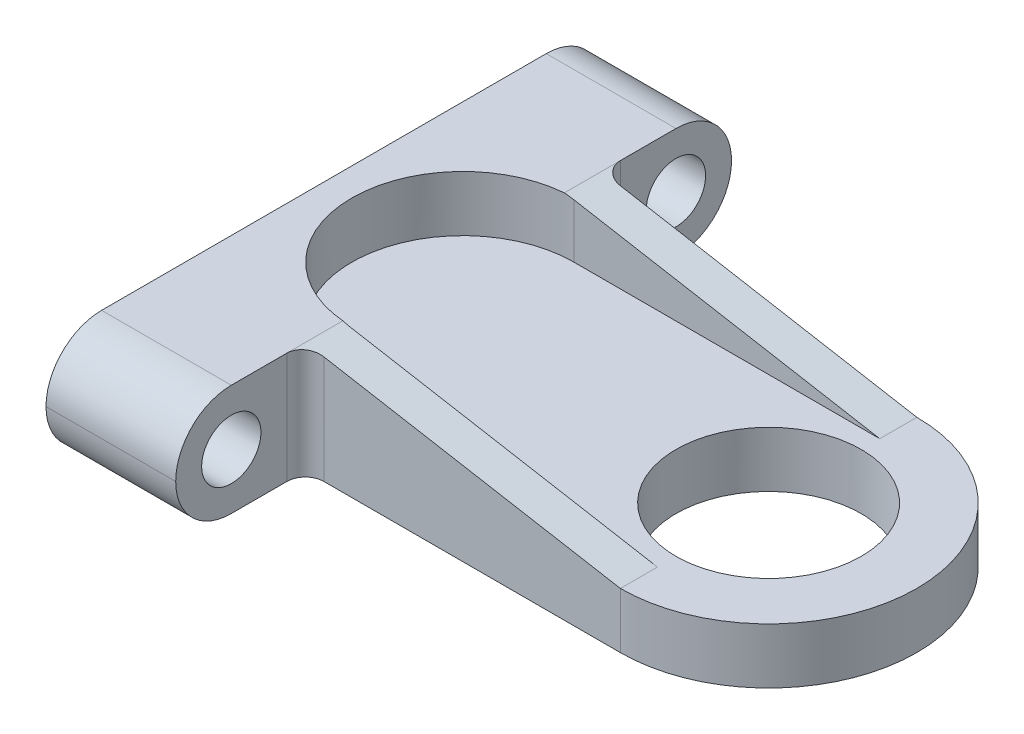
ISO-10303-21;
HEADER;
FILE_DESCRIPTION(('STEP AP214'),'2;1');
FILE_NAME('part.step','',(''),(''),'','','');
FILE_SCHEMA(('AUTOMOTIVE_DESIGN { 1 0 10303 214 1 1 1 1 }'));
ENDSEC;
DATA;
#1=APPLICATION_CONTEXT('core data for automotive mechanical design processes');
#2=APPLICATION_PROTOCOL_DEFINITION('international standard','automotive_design',2000,#1);
#3=PRODUCT_CONTEXT('',#1,'mechanical');
#4=PRODUCT('Part','Part','',(#3));
#5=PRODUCT_RELATED_PRODUCT_CATEGORY('part','',(#4));
#6=PRODUCT_DEFINITION_FORMATION('','',#4);
#7=PRODUCT_DEFINITION_CONTEXT('part definition',#1,'design');
#8=PRODUCT_DEFINITION('design','',#6,#7);
#9=PRODUCT_DEFINITION_SHAPE('','',#8);
#10=(LENGTH_UNIT() NAMED_UNIT(*) SI_UNIT(.MILLI.,.METRE.));
#11=(NAMED_UNIT(*) PLANE_ANGLE_UNIT() SI_UNIT($,.RADIAN.));
#12=(NAMED_UNIT(*) SI_UNIT($,.STERADIAN.) SOLID_ANGLE_UNIT());
#13=UNCERTAINTY_MEASURE_WITH_UNIT(LENGTH_MEASURE(1.E-05),#10,'distance_accuracy_value','');
#14=(GEOMETRIC_REPRESENTATION_CONTEXT(3) GLOBAL_UNCERTAINTY_ASSIGNED_CONTEXT((#13)) GLOBAL_UNIT_ASSIGNED_CONTEXT((#10,
#11,#12)) REPRESENTATION_CONTEXT('',''));
#15=CARTESIAN_POINT('',(0.,0.,0.));
#16=DIRECTION('',(0.,0.,1.));
#17=DIRECTION('',(1.,0.,0.));
#18=AXIS2_PLACEMENT_3D('',#15,#16,#17);
#19=CARTESIAN_POINT('',(0.,6.,0.));
#20=DIRECTION('',(0.,1.,0.));
#21=DIRECTION('',(0.,0.,1.));
#22=AXIS2_PLACEMENT_3D('',#19,#20,#21);
#23=PLANE('',#22);
#24=DIRECTION('',(0.,0.,1.));
#25=VECTOR('',#24,1.);
#26=CARTESIAN_POINT('',(-17.,6.,-15.));
#27=LINE('',#26,#25);
#28=CARTESIAN_POINT('',(-17.,6.,5.9791303715507));
#29=VERTEX_POINT('',#28);
#30=CARTESIAN_POINT('',(-17.,6.,9.));
#31=VERTEX_POINT('',#30);
#32=EDGE_CURVE('E169',#29,#31,#27,.T.);
#33=ORIENTED_EDGE('',*,*,#32,.F.);
#34=CARTESIAN_POINT('',(-16.5,6.,0.));
#35=DIRECTION('',(0.,1.,0.));
#36=DIRECTION('',(-1.,0.,0.));
#37=AXIS2_PLACEMENT_3D('',#34,#35,#36);
#38=CIRCLE('',#37,6.);
#39=CARTESIAN_POINT('',(-17.,6.,-5.9791303715507));
#40=VERTEX_POINT('',#39);
#41=EDGE_CURVE('E541',#40,#29,#38,.T.);
#42=ORIENTED_EDGE('',*,*,#41,.F.);
#43=CARTESIAN_POINT('',(-17.,6.,-9.00000000000001));
#44=VERTEX_POINT('',#43);
#45=EDGE_CURVE('E48',#44,#40,#27,.T.);
#46=ORIENTED_EDGE('',*,*,#45,.F.);
#47=DIRECTION('',(0.,0.,-1.));
#48=VECTOR('',#47,1.);
#49=CARTESIAN_POINT('',(-17.,6.,-15.));
#50=LINE('',#49,#48);
#51=CARTESIAN_POINT('',(-17.,6.,-12.));
#52=VERTEX_POINT('',#51);
#53=EDGE_CURVE('E201',#44,#52,#50,.T.);
#54=ORIENTED_EDGE('',*,*,#53,.T.);
#55=DIRECTION('',(-1.,0.,0.));
#56=VECTOR('',#55,1.);
#57=CARTESIAN_POINT('',(-24.,6.,-12.));
#58=LINE('',#57,#56);
#59=CARTESIAN_POINT('',(-24.,6.,-12.));
#60=VERTEX_POINT('',#59);
#61=EDGE_CURVE('E243',#52,#60,#58,.T.);
#62=ORIENTED_EDGE('',*,*,#61,.T.);
#63=DIRECTION('',(0.,0.,1.));
#64=VECTOR('',#63,1.);
#65=CARTESIAN_POINT('',(-24.,6.,-15.));
#66=LINE('',#65,#64);
#67=CARTESIAN_POINT('',(-24.,6.,12.));
#68=VERTEX_POINT('',#67);
#69=EDGE_CURVE('E194',#60,#68,#66,.T.);
#70=ORIENTED_EDGE('',*,*,#69,.T.);
#71=DIRECTION('',(1.,0.,0.));
#72=VECTOR('',#71,1.);
#73=CARTESIAN_POINT('',(-17.,6.,12.));
#74=LINE('',#73,#72);
#75=CARTESIAN_POINT('',(-17.,6.,12.));
#76=VERTEX_POINT('',#75);
#77=EDGE_CURVE('E241',#68,#76,#74,.T.);
#78=ORIENTED_EDGE('',*,*,#77,.T.);
#79=DIRECTION('',(0.,0.,-1.));
#80=VECTOR('',#79,1.);
#81=CARTESIAN_POINT('',(-17.,6.,8.));
#82=LINE('',#81,#80);
#83=EDGE_CURVE('E197',#76,#31,#82,.T.);
#84=ORIENTED_EDGE('',*,*,#83,.T.);
#85=EDGE_LOOP('',(#33,#42,#46,#54,#62,#70,#78,#84));
#86=FACE_BOUND('',#85,.T.);
#87=ADVANCED_FACE('F33',(#86),#23,.T.);
#88=CARTESIAN_POINT('',(0.,6.,0.));
#89=DIRECTION('',(0.,-1.,0.));
#90=DIRECTION('',(0.,0.,-1.));
#91=AXIS2_PLACEMENT_3D('',#88,#89,#90);
#92=CYLINDRICAL_SURFACE('',#91,5.);
#93=CARTESIAN_POINT('',(0.,0.,0.));
#94=DIRECTION('',(0.,1.,0.));
#95=DIRECTION('',(0.,0.,1.));
#96=AXIS2_PLACEMENT_3D('',#93,#94,#95);
#97=CIRCLE('',#96,5.);
#98=CARTESIAN_POINT('',(0.,0.,5.));
#99=VERTEX_POINT('',#98);
#100=EDGE_CURVE('E189',#99,#99,#97,.T.);
#101=ORIENTED_EDGE('',*,*,#100,.F.);
#102=EDGE_LOOP('',(#101));
#103=FACE_BOUND('',#102,.T.);
#104=CARTESIAN_POINT('',(0.,3.,0.));
#105=DIRECTION('',(0.,-1.,0.));
#106=DIRECTION('',(1.,0.,0.));
#107=AXIS2_PLACEMENT_3D('',#104,#105,#106);
#108=CIRCLE('',#107,5.);
#109=CARTESIAN_POINT('',(5.,3.,0.));
#110=VERTEX_POINT('',#109);
#111=EDGE_CURVE('E249',#110,#110,#108,.T.);
#112=ORIENTED_EDGE('',*,*,#111,.F.);
#113=EDGE_LOOP('',(#112));
#114=FACE_BOUND('',#113,.T.);
#115=ADVANCED_FACE('F352',(#103,#114),#92,.F.);
#116=CARTESIAN_POINT('',(0.,3.,-15.));
#117=DIRECTION('',(-0.173785333909048,-0.984783558817937,0.));
#118=DIRECTION('',(0.984783558817937,-0.173785333909048,0.));
#119=AXIS2_PLACEMENT_3D('',#116,#117,#118);
#120=PLANE('',#119);
#121=DIRECTION('',(-0.984783558817937,0.173785333909048,0.));
#122=VECTOR('',#121,1.);
#123=CARTESIAN_POINT('',(0.,3.,-6.));
#124=LINE('',#123,#122);
#125=CARTESIAN_POINT('',(0.,3.,-6.));
#126=VERTEX_POINT('',#125);
#127=CARTESIAN_POINT('',(-16.5,5.91176470588235,-6.));
#128=VERTEX_POINT('',#127);
#129=EDGE_CURVE('E144',#126,#128,#124,.T.);
#130=ORIENTED_EDGE('',*,*,#129,.F.);
#131=DIRECTION('',(0.,0.,1.));
#132=VECTOR('',#131,1.);
#133=CARTESIAN_POINT('',(0.,3.,-15.));
#134=LINE('',#133,#132);
#135=CARTESIAN_POINT('',(0.,3.,-8.));
#136=VERTEX_POINT('',#135);
#137=EDGE_CURVE('E158',#136,#126,#134,.T.);
#138=ORIENTED_EDGE('',*,*,#137,.F.);
#139=DIRECTION('',(0.984783558817937,-0.173785333909048,0.));
#140=VECTOR('',#139,1.);
#141=CARTESIAN_POINT('',(-0.513422818791947,3.09060402684564,-8.));
#142=LINE('',#141,#140);
#143=CARTESIAN_POINT('',(-16.,5.82352941176471,-8.));
#144=VERTEX_POINT('',#143);
#145=EDGE_CURVE('E175',#144,#136,#142,.T.);
#146=ORIENTED_EDGE('',*,*,#145,.F.);
#147=CARTESIAN_POINT('',(-16.,5.82352941176471,-9.));
#148=DIRECTION('',(-0.173785333909048,-0.984783558817937,0.));
#149=DIRECTION('',(-0.984783558817937,0.173785333909048,0.));
#150=AXIS2_PLACEMENT_3D('',#147,#148,#149);
#151=ELLIPSE('',#150,1.01545155891953,1.);
#152=EDGE_CURVE('E277',#144,#44,#151,.T.);
#153=ORIENTED_EDGE('',*,*,#152,.T.);
#154=ORIENTED_EDGE('',*,*,#45,.T.);
#155=CARTESIAN_POINT('',(-16.5,5.91176470588235,0.));
#156=DIRECTION('',(-0.173785333909048,-0.984783558817937,0.));
#157=DIRECTION('',(0.984783558817937,-0.173785333909048,0.));
#158=AXIS2_PLACEMENT_3D('',#155,#156,#157);
#159=ELLIPSE('',#158,6.0927093535172,6.);
#160=EDGE_CURVE('E160',#128,#40,#159,.F.);
#161=ORIENTED_EDGE('',*,*,#160,.F.);
#162=EDGE_LOOP('',(#130,#138,#146,#153,#154,#161));
#163=FACE_BOUND('',#162,.T.);
#164=ADVANCED_FACE('F156',(#163),#120,.F.);
#165=CARTESIAN_POINT('',(-16.5,5.91176470588235,6.));
#166=VERTEX_POINT('',#165);
#167=EDGE_CURVE('E263',#29,#166,#159,.F.);
#168=ORIENTED_EDGE('',*,*,#167,.F.);
#169=ORIENTED_EDGE('',*,*,#32,.T.);
#170=CARTESIAN_POINT('',(-16.,5.82352941176471,9.));
#171=DIRECTION('',(-0.173785333909048,-0.984783558817937,0.));
#172=DIRECTION('',(-0.984783558817937,0.173785333909048,0.));
#173=AXIS2_PLACEMENT_3D('',#170,#171,#172);
#174=ELLIPSE('',#173,1.01545155891953,1.);
#175=CARTESIAN_POINT('',(-16.,5.82352941176471,8.));
#176=VERTEX_POINT('',#175);
#177=EDGE_CURVE('E11',#31,#176,#174,.T.);
#178=ORIENTED_EDGE('',*,*,#177,.T.);
#179=DIRECTION('',(-0.984783558817937,0.173785333909048,0.));
#180=VECTOR('',#179,1.);
#181=CARTESIAN_POINT('',(-0.513422818791947,3.09060402684564,8.));
#182=LINE('',#181,#180);
#183=CARTESIAN_POINT('',(0.,3.,8.));
#184=VERTEX_POINT('',#183);
#185=EDGE_CURVE('E177',#184,#176,#182,.T.);
#186=ORIENTED_EDGE('',*,*,#185,.F.);
#187=CARTESIAN_POINT('',(0.,3.,6.));
#188=VERTEX_POINT('',#187);
#189=EDGE_CURVE('E170',#188,#184,#134,.T.);
#190=ORIENTED_EDGE('',*,*,#189,.F.);
#191=DIRECTION('',(0.984783558817937,-0.173785333909048,0.));
#192=VECTOR('',#191,1.);
#193=CARTESIAN_POINT('',(0.,3.,6.));
#194=LINE('',#193,#192);
#195=EDGE_CURVE('E261',#166,#188,#194,.T.);
#196=ORIENTED_EDGE('',*,*,#195,.F.);
#197=EDGE_LOOP('',(#168,#169,#178,#186,#190,#196));
#198=FACE_BOUND('',#197,.T.);
#199=ADVANCED_FACE('F298',(#198),#120,.F.);
#200=CARTESIAN_POINT('',(0.,0.,0.));
#201=DIRECTION('',(0.,1.,0.));
#202=DIRECTION('',(0.,0.,1.));
#203=AXIS2_PLACEMENT_3D('',#200,#201,#202);
#204=PLANE('',#203);
#205=DIRECTION('',(0.,0.,1.));
#206=VECTOR('',#205,1.);
#207=CARTESIAN_POINT('',(-24.,0.,-15.));
#208=LINE('',#207,#206);
#209=CARTESIAN_POINT('',(-24.,0.,-12.));
#210=VERTEX_POINT('',#209);
#211=CARTESIAN_POINT('',(-24.,0.,12.));
#212=VERTEX_POINT('',#211);
#213=EDGE_CURVE('E192',#210,#212,#208,.T.);
#214=ORIENTED_EDGE('',*,*,#213,.F.);
#215=DIRECTION('',(-1.,0.,0.));
#216=VECTOR('',#215,1.);
#217=CARTESIAN_POINT('',(0.,0.,-12.));
#218=LINE('',#217,#216);
#219=CARTESIAN_POINT('',(-17.,0.,-12.));
#220=VERTEX_POINT('',#219);
#221=EDGE_CURVE('E233',#210,#220,#218,.F.);
#222=ORIENTED_EDGE('',*,*,#221,.T.);
#223=DIRECTION('',(0.,0.,-1.));
#224=VECTOR('',#223,1.);
#225=CARTESIAN_POINT('',(-17.,0.,-15.));
#226=LINE('',#225,#224);
#227=CARTESIAN_POINT('',(-17.,0.,-9.00000000000001));
#228=VERTEX_POINT('',#227);
#229=EDGE_CURVE('E198',#228,#220,#226,.T.);
#230=ORIENTED_EDGE('',*,*,#229,.F.);
#231=CARTESIAN_POINT('',(-16.,0.,-9.));
#232=DIRECTION('',(0.,1.,0.));
#233=DIRECTION('',(0.,0.,1.));
#234=AXIS2_PLACEMENT_3D('',#231,#232,#233);
#235=CIRCLE('',#234,1.);
#236=CARTESIAN_POINT('',(-16.,0.,-8.));
#237=VERTEX_POINT('',#236);
#238=EDGE_CURVE('E275',#228,#237,#235,.T.);
#239=ORIENTED_EDGE('',*,*,#238,.T.);
#240=DIRECTION('',(-1.,0.,0.));
#241=VECTOR('',#240,1.);
#242=CARTESIAN_POINT('',(0.,0.,-8.));
#243=LINE('',#242,#241);
#244=CARTESIAN_POINT('',(0.,0.,-8.));
#245=VERTEX_POINT('',#244);
#246=EDGE_CURVE('E214',#245,#237,#243,.T.);
#247=ORIENTED_EDGE('',*,*,#246,.F.);
#248=CARTESIAN_POINT('',(0.,0.,0.));
#249=DIRECTION('',(0.,1.,0.));
#250=DIRECTION('',(0.,0.,1.));
#251=AXIS2_PLACEMENT_3D('',#248,#249,#250);
#252=CIRCLE('',#251,8.);
#253=CARTESIAN_POINT('',(0.,0.,8.));
#254=VERTEX_POINT('',#253);
#255=EDGE_CURVE('E211',#254,#245,#252,.T.);
#256=ORIENTED_EDGE('',*,*,#255,.F.);
#257=DIRECTION('',(1.,0.,0.));
#258=VECTOR('',#257,1.);
#259=CARTESIAN_POINT('',(0.,0.,8.));
#260=LINE('',#259,#258);
#261=CARTESIAN_POINT('',(-16.,0.,8.));
#262=VERTEX_POINT('',#261);
#263=EDGE_CURVE('E209',#262,#254,#260,.T.);
#264=ORIENTED_EDGE('',*,*,#263,.F.);
#265=CARTESIAN_POINT('',(-16.,0.,9.));
#266=DIRECTION('',(0.,1.,0.));
#267=DIRECTION('',(0.,0.,1.));
#268=AXIS2_PLACEMENT_3D('',#265,#266,#267);
#269=CIRCLE('',#268,1.);
#270=CARTESIAN_POINT('',(-17.,0.,9.));
#271=VERTEX_POINT('',#270);
#272=EDGE_CURVE('E42',#262,#271,#269,.T.);
#273=ORIENTED_EDGE('',*,*,#272,.T.);
#274=DIRECTION('',(0.,0.,-1.));
#275=VECTOR('',#274,1.);
#276=CARTESIAN_POINT('',(-17.,0.,8.));
#277=LINE('',#276,#275);
#278=CARTESIAN_POINT('',(-17.,0.,12.));
#279=VERTEX_POINT('',#278);
#280=EDGE_CURVE('E206',#279,#271,#277,.T.);
#281=ORIENTED_EDGE('',*,*,#280,.F.);
#282=DIRECTION('',(1.,0.,0.));
#283=VECTOR('',#282,1.);
#284=CARTESIAN_POINT('',(0.,0.,12.));
#285=LINE('',#284,#283);
#286=EDGE_CURVE('E230',#279,#212,#285,.F.);
#287=ORIENTED_EDGE('',*,*,#286,.T.);
#288=EDGE_LOOP('',(#214,#222,#230,#239,#247,#256,#264,#273,#281,#287));
#289=FACE_BOUND('',#288,.T.);
#290=ORIENTED_EDGE('',*,*,#100,.T.);
#291=EDGE_LOOP('',(#290));
#292=FACE_BOUND('',#291,.T.);
#293=ADVANCED_FACE('F283',(#289,#292),#204,.F.);
#294=CARTESIAN_POINT('',(-24.,6.,-15.));
#295=DIRECTION('',(1.,0.,0.));
#296=DIRECTION('',(0.,0.,-1.));
#297=AXIS2_PLACEMENT_3D('',#294,#295,#296);
#298=PLANE('',#297);
#299=CARTESIAN_POINT('',(-24.,3.,12.));
#300=DIRECTION('',(-1.,0.,0.));
#301=DIRECTION('',(0.,0.,1.));
#302=AXIS2_PLACEMENT_3D('',#299,#300,#301);
#303=CIRCLE('',#302,1.6);
#304=CARTESIAN_POINT('',(-24.,3.,13.6));
#305=VERTEX_POINT('',#304);
#306=EDGE_CURVE('E181',#305,#305,#303,.T.);
#307=ORIENTED_EDGE('',*,*,#306,.F.);
#308=EDGE_LOOP('',(#307));
#309=FACE_BOUND('',#308,.T.);
#310=CARTESIAN_POINT('',(-24.,3.,-12.));
#311=DIRECTION('',(-1.,0.,0.));
#312=DIRECTION('',(0.,0.,1.));
#313=AXIS2_PLACEMENT_3D('',#310,#311,#312);
#314=CIRCLE('',#313,1.6);
#315=CARTESIAN_POINT('',(-24.,3.,-10.4));
#316=VERTEX_POINT('',#315);
#317=EDGE_CURVE('E185',#316,#316,#314,.T.);
#318=ORIENTED_EDGE('',*,*,#317,.F.);
#319=EDGE_LOOP('',(#318));
#320=FACE_BOUND('',#319,.T.);
#321=CARTESIAN_POINT('',(-24.,3.,-12.));
#322=DIRECTION('',(1.,0.,0.));
#323=DIRECTION('',(0.,0.,-1.));
#324=AXIS2_PLACEMENT_3D('',#321,#322,#323);
#325=CIRCLE('',#324,3.);
#326=CARTESIAN_POINT('',(-24.,3.,-15.));
#327=VERTEX_POINT('',#326);
#328=EDGE_CURVE('E226',#60,#327,#325,.F.);
#329=ORIENTED_EDGE('',*,*,#328,.T.);
#330=CARTESIAN_POINT('',(-24.,3.,-12.));
#331=DIRECTION('',(1.,0.,0.));
#332=DIRECTION('',(0.,0.,-1.));
#333=AXIS2_PLACEMENT_3D('',#330,#331,#332);
#334=CIRCLE('',#333,3.);
#335=EDGE_CURVE('E228',#327,#210,#334,.F.);
#336=ORIENTED_EDGE('',*,*,#335,.T.);
#337=ORIENTED_EDGE('',*,*,#213,.T.);
#338=CARTESIAN_POINT('',(-24.,3.,12.));
#339=DIRECTION('',(1.,0.,0.));
#340=DIRECTION('',(0.,0.,-1.));
#341=AXIS2_PLACEMENT_3D('',#338,#339,#340);
#342=CIRCLE('',#341,3.);
#343=CARTESIAN_POINT('',(-24.,3.,15.));
#344=VERTEX_POINT('',#343);
#345=EDGE_CURVE('E224',#212,#344,#342,.F.);
#346=ORIENTED_EDGE('',*,*,#345,.T.);
#347=CARTESIAN_POINT('',(-24.,3.,12.));
#348=DIRECTION('',(1.,0.,0.));
#349=DIRECTION('',(0.,0.,-1.));
#350=AXIS2_PLACEMENT_3D('',#347,#348,#349);
#351=CIRCLE('',#350,3.);
#352=EDGE_CURVE('E222',#344,#68,#351,.F.);
#353=ORIENTED_EDGE('',*,*,#352,.T.);
#354=ORIENTED_EDGE('',*,*,#69,.F.);
#355=EDGE_LOOP('',(#329,#336,#337,#346,#353,#354));
#356=FACE_BOUND('',#355,.T.);
#357=ADVANCED_FACE('F331',(#309,#320,#356),#298,.F.);
#358=CARTESIAN_POINT('',(-17.,6.,8.));
#359=DIRECTION('',(-1.,0.,0.));
#360=DIRECTION('',(0.,0.,1.));
#361=AXIS2_PLACEMENT_3D('',#358,#359,#360);
#362=PLANE('',#361);
#363=CARTESIAN_POINT('',(-17.,3.,12.));
#364=DIRECTION('',(-1.,0.,0.));
#365=DIRECTION('',(0.,0.,1.));
#366=AXIS2_PLACEMENT_3D('',#363,#364,#365);
#367=CIRCLE('',#366,1.6);
#368=CARTESIAN_POINT('',(-17.,3.,13.6));
#369=VERTEX_POINT('',#368);
#370=EDGE_CURVE('E184',#369,#369,#367,.T.);
#371=ORIENTED_EDGE('',*,*,#370,.T.);
#372=EDGE_LOOP('',(#371));
#373=FACE_BOUND('',#372,.T.);
#374=ORIENTED_EDGE('',*,*,#280,.T.);
#375=DIRECTION('',(0.,-1.,0.));
#376=VECTOR('',#375,1.);
#377=CARTESIAN_POINT('',(-17.,6.,9.));
#378=LINE('',#377,#376);
#379=EDGE_CURVE('E272',#271,#31,#378,.F.);
#380=ORIENTED_EDGE('',*,*,#379,.T.);
#381=ORIENTED_EDGE('',*,*,#83,.F.);
#382=CARTESIAN_POINT('',(-17.,3.,12.));
#383=DIRECTION('',(-1.,0.,0.));
#384=DIRECTION('',(0.,0.,1.));
#385=AXIS2_PLACEMENT_3D('',#382,#383,#384);
#386=CIRCLE('',#385,3.);
#387=CARTESIAN_POINT('',(-17.,3.,15.));
#388=VERTEX_POINT('',#387);
#389=EDGE_CURVE('E245',#76,#388,#386,.F.);
#390=ORIENTED_EDGE('',*,*,#389,.T.);
#391=CARTESIAN_POINT('',(-17.,3.,12.));
#392=DIRECTION('',(-1.,0.,0.));
#393=DIRECTION('',(0.,0.,1.));
#394=AXIS2_PLACEMENT_3D('',#391,#392,#393);
#395=CIRCLE('',#394,3.);
#396=EDGE_CURVE('E247',#388,#279,#395,.F.);
#397=ORIENTED_EDGE('',*,*,#396,.T.);
#398=EDGE_LOOP('',(#374,#380,#381,#390,#397));
#399=FACE_BOUND('',#398,.T.);
#400=ADVANCED_FACE('F291',(#373,#399),#362,.F.);
#401=CARTESIAN_POINT('',(0.,6.,8.));
#402=DIRECTION('',(0.,0.,-1.));
#403=DIRECTION('',(-1.,0.,0.));
#404=AXIS2_PLACEMENT_3D('',#401,#402,#403);
#405=PLANE('',#404);
#406=ORIENTED_EDGE('',*,*,#185,.T.);
#407=DIRECTION('',(0.,-1.,0.));
#408=VECTOR('',#407,1.);
#409=CARTESIAN_POINT('',(-16.,0.,8.));
#410=LINE('',#409,#408);
#411=EDGE_CURVE('E269',#176,#262,#410,.T.);
#412=ORIENTED_EDGE('',*,*,#411,.T.);
#413=ORIENTED_EDGE('',*,*,#263,.T.);
#414=DIRECTION('',(0.,-1.,0.));
#415=VECTOR('',#414,1.);
#416=CARTESIAN_POINT('',(0.,6.,8.));
#417=LINE('',#416,#415);
#418=EDGE_CURVE('E219',#184,#254,#417,.T.);
#419=ORIENTED_EDGE('',*,*,#418,.F.);
#420=EDGE_LOOP('',(#406,#412,#413,#419));
#421=FACE_BOUND('',#420,.T.);
#422=ADVANCED_FACE('F303',(#421),#405,.F.);
#423=CARTESIAN_POINT('',(0.,6.,0.));
#424=DIRECTION('',(0.,-1.,0.));
#425=DIRECTION('',(0.,0.,-1.));
#426=AXIS2_PLACEMENT_3D('',#423,#424,#425);
#427=CYLINDRICAL_SURFACE('',#426,8.);
#428=CARTESIAN_POINT('',(0.,3.,0.));
#429=DIRECTION('',(0.,-1.,0.));
#430=DIRECTION('',(1.,0.,0.));
#431=AXIS2_PLACEMENT_3D('',#428,#429,#430);
#432=CIRCLE('',#431,8.);
#433=EDGE_CURVE('E167',#136,#184,#432,.T.);
#434=ORIENTED_EDGE('',*,*,#433,.T.);
#435=ORIENTED_EDGE('',*,*,#418,.T.);
#436=ORIENTED_EDGE('',*,*,#255,.T.);
#437=DIRECTION('',(0.,-1.,0.));
#438=VECTOR('',#437,1.);
#439=CARTESIAN_POINT('',(0.,6.,-8.));
#440=LINE('',#439,#438);
#441=EDGE_CURVE('E203',#136,#245,#440,.T.);
#442=ORIENTED_EDGE('',*,*,#441,.F.);
#443=EDGE_LOOP('',(#434,#435,#436,#442));
#444=FACE_BOUND('',#443,.T.);
#445=ADVANCED_FACE('F305',(#444),#427,.T.);
#446=CARTESIAN_POINT('',(0.,6.,-8.));
#447=DIRECTION('',(0.,0.,1.));
#448=DIRECTION('',(1.,0.,0.));
#449=AXIS2_PLACEMENT_3D('',#446,#447,#448);
#450=PLANE('',#449);
#451=ORIENTED_EDGE('',*,*,#246,.T.);
#452=DIRECTION('',(0.,-1.,0.));
#453=VECTOR('',#452,1.);
#454=CARTESIAN_POINT('',(-16.,6.,-8.));
#455=LINE('',#454,#453);
#456=EDGE_CURVE('E267',#237,#144,#455,.F.);
#457=ORIENTED_EDGE('',*,*,#456,.T.);
#458=ORIENTED_EDGE('',*,*,#145,.T.);
#459=ORIENTED_EDGE('',*,*,#441,.T.);
#460=EDGE_LOOP('',(#451,#457,#458,#459));
#461=FACE_BOUND('',#460,.T.);
#462=ADVANCED_FACE('F310',(#461),#450,.F.);
#463=CARTESIAN_POINT('',(-17.,6.,-15.));
#464=DIRECTION('',(-1.,0.,0.));
#465=DIRECTION('',(0.,0.,1.));
#466=AXIS2_PLACEMENT_3D('',#463,#464,#465);
#467=PLANE('',#466);
#468=CARTESIAN_POINT('',(-17.,3.,-12.));
#469=DIRECTION('',(-1.,0.,0.));
#470=DIRECTION('',(0.,0.,1.));
#471=AXIS2_PLACEMENT_3D('',#468,#469,#470);
#472=CIRCLE('',#471,1.6);
#473=CARTESIAN_POINT('',(-17.,3.,-10.4));
#474=VERTEX_POINT('',#473);
#475=EDGE_CURVE('E188',#474,#474,#472,.T.);
#476=ORIENTED_EDGE('',*,*,#475,.T.);
#477=EDGE_LOOP('',(#476));
#478=FACE_BOUND('',#477,.T.);
#479=ORIENTED_EDGE('',*,*,#53,.F.);
#480=DIRECTION('',(0.,-1.,0.));
#481=VECTOR('',#480,1.);
#482=CARTESIAN_POINT('',(-17.,0.,-9.));
#483=LINE('',#482,#481);
#484=EDGE_CURVE('E161',#44,#228,#483,.T.);
#485=ORIENTED_EDGE('',*,*,#484,.T.);
#486=ORIENTED_EDGE('',*,*,#229,.T.);
#487=CARTESIAN_POINT('',(-17.,3.,-12.));
#488=DIRECTION('',(-1.,0.,0.));
#489=DIRECTION('',(0.,0.,1.));
#490=AXIS2_PLACEMENT_3D('',#487,#488,#489);
#491=CIRCLE('',#490,3.);
#492=CARTESIAN_POINT('',(-17.,3.,-15.));
#493=VERTEX_POINT('',#492);
#494=EDGE_CURVE('E239',#220,#493,#491,.F.);
#495=ORIENTED_EDGE('',*,*,#494,.T.);
#496=CARTESIAN_POINT('',(-17.,3.,-12.));
#497=DIRECTION('',(-1.,0.,0.));
#498=DIRECTION('',(0.,0.,1.));
#499=AXIS2_PLACEMENT_3D('',#496,#497,#498);
#500=CIRCLE('',#499,3.);
#501=EDGE_CURVE('E236',#493,#52,#500,.F.);
#502=ORIENTED_EDGE('',*,*,#501,.T.);
#503=EDGE_LOOP('',(#479,#485,#486,#495,#502));
#504=FACE_BOUND('',#503,.T.);
#505=ADVANCED_FACE('F316',(#478,#504),#467,.F.);
#506=CARTESIAN_POINT('',(0.,3.,-12.));
#507=DIRECTION('',(1.,0.,0.));
#508=DIRECTION('',(0.,0.,-1.));
#509=AXIS2_PLACEMENT_3D('',#506,#507,#508);
#510=CYLINDRICAL_SURFACE('',#509,3.);
#511=ORIENTED_EDGE('',*,*,#61,.F.);
#512=ORIENTED_EDGE('',*,*,#501,.F.);
#513=DIRECTION('',(-1.,0.,0.));
#514=VECTOR('',#513,1.);
#515=CARTESIAN_POINT('',(-17.,3.,-15.));
#516=LINE('',#515,#514);
#517=EDGE_CURVE('E193',#327,#493,#516,.F.);
#518=ORIENTED_EDGE('',*,*,#517,.F.);
#519=ORIENTED_EDGE('',*,*,#328,.F.);
#520=EDGE_LOOP('',(#511,#512,#518,#519));
#521=FACE_BOUND('',#520,.T.);
#522=ADVANCED_FACE('F326',(#521),#510,.T.);
#523=CARTESIAN_POINT('',(-24.,3.,-12.));
#524=DIRECTION('',(-1.,0.,0.));
#525=DIRECTION('',(0.,0.,1.));
#526=AXIS2_PLACEMENT_3D('',#523,#524,#525);
#527=CYLINDRICAL_SURFACE('',#526,3.);
#528=ORIENTED_EDGE('',*,*,#494,.F.);
#529=ORIENTED_EDGE('',*,*,#221,.F.);
#530=ORIENTED_EDGE('',*,*,#335,.F.);
#531=ORIENTED_EDGE('',*,*,#517,.T.);
#532=EDGE_LOOP('',(#528,#529,#530,#531));
#533=FACE_BOUND('',#532,.T.);
#534=ADVANCED_FACE('F321',(#533),#527,.T.);
#535=CARTESIAN_POINT('',(0.,3.,12.));
#536=DIRECTION('',(-1.,0.,0.));
#537=DIRECTION('',(0.,0.,1.));
#538=AXIS2_PLACEMENT_3D('',#535,#536,#537);
#539=CYLINDRICAL_SURFACE('',#538,3.);
#540=ORIENTED_EDGE('',*,*,#77,.F.);
#541=ORIENTED_EDGE('',*,*,#352,.F.);
#542=DIRECTION('',(1.,0.,0.));
#543=VECTOR('',#542,1.);
#544=CARTESIAN_POINT('',(-24.,3.,15.));
#545=LINE('',#544,#543);
#546=EDGE_CURVE('E252',#388,#344,#545,.F.);
#547=ORIENTED_EDGE('',*,*,#546,.F.);
#548=ORIENTED_EDGE('',*,*,#389,.F.);
#549=EDGE_LOOP('',(#540,#541,#547,#548));
#550=FACE_BOUND('',#549,.T.);
#551=ADVANCED_FACE('F335',(#550),#539,.T.);
#552=CARTESIAN_POINT('',(-24.,3.,12.));
#553=DIRECTION('',(1.,0.,0.));
#554=DIRECTION('',(0.,0.,-1.));
#555=AXIS2_PLACEMENT_3D('',#552,#553,#554);
#556=CYLINDRICAL_SURFACE('',#555,3.);
#557=ORIENTED_EDGE('',*,*,#345,.F.);
#558=ORIENTED_EDGE('',*,*,#286,.F.);
#559=ORIENTED_EDGE('',*,*,#396,.F.);
#560=ORIENTED_EDGE('',*,*,#546,.T.);
#561=EDGE_LOOP('',(#557,#558,#559,#560));
#562=FACE_BOUND('',#561,.T.);
#563=ADVANCED_FACE('F338',(#562),#556,.T.);
#564=CARTESIAN_POINT('',(8.,3.,-12.));
#565=DIRECTION('',(-1.,0.,0.));
#566=DIRECTION('',(0.,0.,1.));
#567=AXIS2_PLACEMENT_3D('',#564,#565,#566);
#568=CYLINDRICAL_SURFACE('',#567,1.6);
#569=ORIENTED_EDGE('',*,*,#317,.T.);
#570=EDGE_LOOP('',(#569));
#571=FACE_BOUND('',#570,.T.);
#572=ORIENTED_EDGE('',*,*,#475,.F.);
#573=EDGE_LOOP('',(#572));
#574=FACE_BOUND('',#573,.T.);
#575=ADVANCED_FACE('F340',(#571,#574),#568,.F.);
#576=CARTESIAN_POINT('',(8.,3.,12.));
#577=DIRECTION('',(-1.,0.,0.));
#578=DIRECTION('',(0.,0.,1.));
#579=AXIS2_PLACEMENT_3D('',#576,#577,#578);
#580=CYLINDRICAL_SURFACE('',#579,1.6);
#581=ORIENTED_EDGE('',*,*,#306,.T.);
#582=EDGE_LOOP('',(#581));
#583=FACE_BOUND('',#582,.T.);
#584=ORIENTED_EDGE('',*,*,#370,.F.);
#585=EDGE_LOOP('',(#584));
#586=FACE_BOUND('',#585,.T.);
#587=ADVANCED_FACE('F346',(#583,#586),#580,.F.);
#588=CARTESIAN_POINT('',(8.,3.,-15.));
#589=DIRECTION('',(0.,-1.,0.));
#590=DIRECTION('',(1.,0.,0.));
#591=AXIS2_PLACEMENT_3D('',#588,#589,#590);
#592=PLANE('',#591);
#593=DIRECTION('',(1.,0.,0.));
#594=VECTOR('',#593,1.);
#595=CARTESIAN_POINT('',(0.,3.,6.));
#596=LINE('',#595,#594);
#597=CARTESIAN_POINT('',(-16.5,3.,6.));
#598=VERTEX_POINT('',#597);
#599=EDGE_CURVE('E539',#598,#188,#596,.T.);
#600=ORIENTED_EDGE('',*,*,#599,.T.);
#601=ORIENTED_EDGE('',*,*,#189,.T.);
#602=ORIENTED_EDGE('',*,*,#433,.F.);
#603=ORIENTED_EDGE('',*,*,#137,.T.);
#604=DIRECTION('',(-1.,0.,0.));
#605=VECTOR('',#604,1.);
#606=CARTESIAN_POINT('',(0.,3.,-6.));
#607=LINE('',#606,#605);
#608=CARTESIAN_POINT('',(-16.5,3.,-6.));
#609=VERTEX_POINT('',#608);
#610=EDGE_CURVE('E141',#126,#609,#607,.T.);
#611=ORIENTED_EDGE('',*,*,#610,.T.);
#612=CARTESIAN_POINT('',(-16.5,3.,0.));
#613=DIRECTION('',(0.,1.,0.));
#614=DIRECTION('',(-1.,0.,0.));
#615=AXIS2_PLACEMENT_3D('',#612,#613,#614);
#616=CIRCLE('',#615,6.);
#617=EDGE_CURVE('E151',#609,#598,#616,.T.);
#618=ORIENTED_EDGE('',*,*,#617,.T.);
#619=EDGE_LOOP('',(#600,#601,#602,#603,#611,#618));
#620=FACE_BOUND('',#619,.T.);
#621=ORIENTED_EDGE('',*,*,#111,.T.);
#622=EDGE_LOOP('',(#621));
#623=FACE_BOUND('',#622,.T.);
#624=ADVANCED_FACE('F164',(#620,#623),#592,.F.);
#625=CARTESIAN_POINT('',(0.,6.,-6.));
#626=DIRECTION('',(0.,0.,1.));
#627=DIRECTION('',(1.,0.,0.));
#628=AXIS2_PLACEMENT_3D('',#625,#626,#627);
#629=PLANE('',#628);
#630=ORIENTED_EDGE('',*,*,#129,.T.);
#631=DIRECTION('',(0.,-1.,0.));
#632=VECTOR('',#631,1.);
#633=CARTESIAN_POINT('',(-16.5,6.,-6.));
#634=LINE('',#633,#632);
#635=EDGE_CURVE('E146',#128,#609,#634,.T.);
#636=ORIENTED_EDGE('',*,*,#635,.T.);
#637=ORIENTED_EDGE('',*,*,#610,.F.);
#638=EDGE_LOOP('',(#630,#636,#637));
#639=FACE_BOUND('',#638,.T.);
#640=ADVANCED_FACE('F143',(#639),#629,.T.);
#641=CARTESIAN_POINT('',(-16.5,6.,0.));
#642=DIRECTION('',(0.,-1.,0.));
#643=DIRECTION('',(1.,0.,0.));
#644=AXIS2_PLACEMENT_3D('',#641,#642,#643);
#645=CYLINDRICAL_SURFACE('',#644,6.);
#646=ORIENTED_EDGE('',*,*,#160,.T.);
#647=ORIENTED_EDGE('',*,*,#41,.T.);
#648=ORIENTED_EDGE('',*,*,#167,.T.);
#649=DIRECTION('',(0.,-1.,0.));
#650=VECTOR('',#649,1.);
#651=CARTESIAN_POINT('',(-16.5,6.,6.));
#652=LINE('',#651,#650);
#653=EDGE_CURVE('E540',#166,#598,#652,.T.);
#654=ORIENTED_EDGE('',*,*,#653,.T.);
#655=ORIENTED_EDGE('',*,*,#617,.F.);
#656=ORIENTED_EDGE('',*,*,#635,.F.);
#657=EDGE_LOOP('',(#646,#647,#648,#654,#655,#656));
#658=FACE_BOUND('',#657,.T.);
#659=ADVANCED_FACE('F453',(#658),#645,.F.);
#660=CARTESIAN_POINT('',(0.,6.,6.));
#661=DIRECTION('',(0.,0.,-1.));
#662=DIRECTION('',(-1.,0.,0.));
#663=AXIS2_PLACEMENT_3D('',#660,#661,#662);
#664=PLANE('',#663);
#665=ORIENTED_EDGE('',*,*,#195,.T.);
#666=ORIENTED_EDGE('',*,*,#599,.F.);
#667=ORIENTED_EDGE('',*,*,#653,.F.);
#668=EDGE_LOOP('',(#665,#666,#667));
#669=FACE_BOUND('',#668,.T.);
#670=ADVANCED_FACE('F462',(#669),#664,.T.);
#671=CARTESIAN_POINT('',(-16.,6.,-9.));
#672=DIRECTION('',(0.,1.,0.));
#673=DIRECTION('',(0.,0.,1.));
#674=AXIS2_PLACEMENT_3D('',#671,#672,#673);
#675=CYLINDRICAL_SURFACE('',#674,1.);
#676=ORIENTED_EDGE('',*,*,#152,.F.);
#677=ORIENTED_EDGE('',*,*,#456,.F.);
#678=ORIENTED_EDGE('',*,*,#238,.F.);
#679=ORIENTED_EDGE('',*,*,#484,.F.);
#680=EDGE_LOOP('',(#676,#677,#678,#679));
#681=FACE_BOUND('',#680,.T.);
#682=ADVANCED_FACE('F313',(#681),#675,.F.);
#683=CARTESIAN_POINT('',(-16.,6.,9.));
#684=DIRECTION('',(0.,1.,0.));
#685=DIRECTION('',(0.,0.,1.));
#686=AXIS2_PLACEMENT_3D('',#683,#684,#685);
#687=CYLINDRICAL_SURFACE('',#686,1.);
#688=ORIENTED_EDGE('',*,*,#177,.F.);
#689=ORIENTED_EDGE('',*,*,#379,.F.);
#690=ORIENTED_EDGE('',*,*,#272,.F.);
#691=ORIENTED_EDGE('',*,*,#411,.F.);
#692=EDGE_LOOP('',(#688,#689,#690,#691));
#693=FACE_BOUND('',#692,.T.);
#694=ADVANCED_FACE('F35',(#693),#687,.F.);
#695=CLOSED_SHELL('',(#87,#115,#164,#199,#293,#357,#400,#422,#445,#462,#505,#522,#534,#551,#563,
#575,#587,#624,#640,#659,#670,#682,#694));
#696=MANIFOLD_SOLID_BREP('B2',#695);
#697=ADVANCED_BREP_SHAPE_REPRESENTATION('',(#18,#696),#14);
#698=SHAPE_DEFINITION_REPRESENTATION(#9,#697);
ENDSEC;
END-ISO-10303-21;
